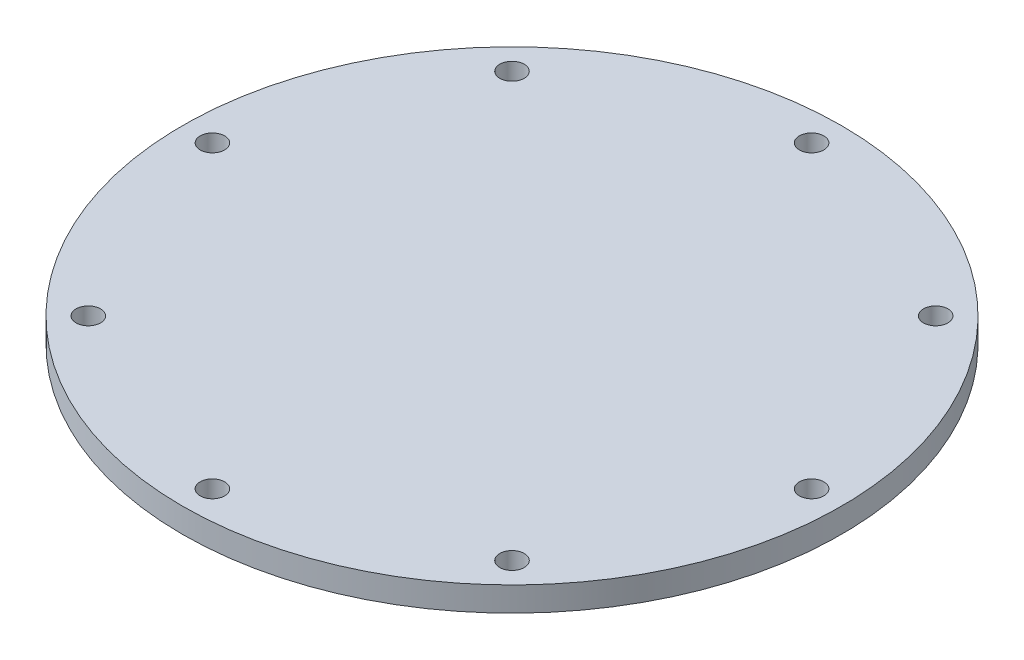
ISO-10303-21;
HEADER;
FILE_DESCRIPTION(('STEP AP214'),'2;1');
FILE_NAME('part.step','',(''),(''),'','','');
FILE_SCHEMA(('AUTOMOTIVE_DESIGN { 1 0 10303 214 1 1 1 1 }'));
ENDSEC;
DATA;
#1=APPLICATION_CONTEXT('core data for automotive mechanical design processes');
#2=APPLICATION_PROTOCOL_DEFINITION('international standard','automotive_design',2000,#1);
#3=PRODUCT_CONTEXT('',#1,'mechanical');
#4=PRODUCT('Part','Part','',(#3));
#5=PRODUCT_RELATED_PRODUCT_CATEGORY('part','',(#4));
#6=PRODUCT_DEFINITION_FORMATION('','',#4);
#7=PRODUCT_DEFINITION_CONTEXT('part definition',#1,'design');
#8=PRODUCT_DEFINITION('design','',#6,#7);
#9=PRODUCT_DEFINITION_SHAPE('','',#8);
#10=(LENGTH_UNIT() NAMED_UNIT(*) SI_UNIT(.MILLI.,.METRE.));
#11=(NAMED_UNIT(*) PLANE_ANGLE_UNIT() SI_UNIT($,.RADIAN.));
#12=(NAMED_UNIT(*) SI_UNIT($,.STERADIAN.) SOLID_ANGLE_UNIT());
#13=UNCERTAINTY_MEASURE_WITH_UNIT(LENGTH_MEASURE(1.E-05),#10,'distance_accuracy_value','');
#14=(GEOMETRIC_REPRESENTATION_CONTEXT(3) GLOBAL_UNCERTAINTY_ASSIGNED_CONTEXT((#13)) GLOBAL_UNIT_ASSIGNED_CONTEXT((#10,
#11,#12)) REPRESENTATION_CONTEXT('',''));
#15=CARTESIAN_POINT('',(0.,0.,0.));
#16=DIRECTION('',(0.,0.,1.));
#17=DIRECTION('',(1.,0.,0.));
#18=AXIS2_PLACEMENT_3D('',#15,#16,#17);
#19=CARTESIAN_POINT('',(0.,2.,0.));
#20=DIRECTION('',(0.,1.,0.));
#21=DIRECTION('',(0.,0.,1.));
#22=AXIS2_PLACEMENT_3D('',#19,#20,#21);
#23=PLANE('',#22);
#24=CARTESIAN_POINT('',(-24.4999999999979,2.,2.08749545080574E-12));
#25=DIRECTION('',(0.,1.,0.));
#26=DIRECTION('',(0.,0.,1.));
#27=AXIS2_PLACEMENT_3D('',#24,#25,#26);
#28=CIRCLE('',#27,1.00000000000285);
#29=CARTESIAN_POINT('',(-24.4999999999979,2.,1.00000000000494));
#30=VERTEX_POINT('',#29);
#31=EDGE_CURVE('E96',#30,#30,#28,.T.);
#32=ORIENTED_EDGE('',*,*,#31,.F.);
#33=EDGE_LOOP('',(#32));
#34=FACE_BOUND('',#33,.T.);
#35=CARTESIAN_POINT('',(4.16899013229566E-12,2.,24.5));
#36=DIRECTION('',(0.,1.,0.));
#37=DIRECTION('',(0.,0.,1.));
#38=AXIS2_PLACEMENT_3D('',#35,#36,#37);
#39=CIRCLE('',#38,1.00000000000415);
#40=CARTESIAN_POINT('',(4.16899013229566E-12,2.,25.5000000000041));
#41=VERTEX_POINT('',#40);
#42=EDGE_CURVE('E80',#41,#41,#39,.T.);
#43=ORIENTED_EDGE('',*,*,#42,.F.);
#44=EDGE_LOOP('',(#43));
#45=FACE_BOUND('',#44,.T.);
#46=CARTESIAN_POINT('',(24.5000000000021,2.,-2.08449506614783E-12));
#47=DIRECTION('',(0.,1.,0.));
#48=DIRECTION('',(0.,0.,1.));
#49=AXIS2_PLACEMENT_3D('',#46,#47,#48);
#50=CIRCLE('',#49,1.00000000000147);
#51=CARTESIAN_POINT('',(24.5000000000021,2.,0.999999999999382));
#52=VERTEX_POINT('',#51);
#53=EDGE_CURVE('E64',#52,#52,#50,.T.);
#54=ORIENTED_EDGE('',*,*,#53,.F.);
#55=EDGE_LOOP('',(#54));
#56=FACE_BOUND('',#55,.T.);
#57=CARTESIAN_POINT('',(17.324116139071,2.,-17.3241161390719));
#58=DIRECTION('',(0.,1.,0.));
#59=DIRECTION('',(0.,0.,1.));
#60=AXIS2_PLACEMENT_3D('',#57,#58,#59);
#61=CIRCLE('',#60,1.0000000000002);
#62=CARTESIAN_POINT('',(17.324116139071,2.,-16.3241161390717));
#63=VERTEX_POINT('',#62);
#64=EDGE_CURVE('E50',#63,#63,#61,.T.);
#65=ORIENTED_EDGE('',*,*,#64,.F.);
#66=EDGE_LOOP('',(#65));
#67=FACE_BOUND('',#66,.T.);
#68=CARTESIAN_POINT('',(0.,2.,0.));
#69=DIRECTION('',(0.,1.,0.));
#70=DIRECTION('',(0.,0.,1.));
#71=AXIS2_PLACEMENT_3D('',#68,#69,#70);
#72=CIRCLE('',#71,26.95);
#73=CARTESIAN_POINT('',(0.,2.,26.95));
#74=VERTEX_POINT('',#73);
#75=EDGE_CURVE('E10',#74,#74,#72,.T.);
#76=ORIENTED_EDGE('',*,*,#75,.T.);
#77=EDGE_LOOP('',(#76));
#78=FACE_BOUND('',#77,.T.);
#79=CARTESIAN_POINT('',(0.,2.,-24.5));
#80=DIRECTION('',(0.,1.,0.));
#81=DIRECTION('',(0.,0.,1.));
#82=AXIS2_PLACEMENT_3D('',#79,#80,#81);
#83=CIRCLE('',#82,1.);
#84=CARTESIAN_POINT('',(0.,2.,-23.5));
#85=VERTEX_POINT('',#84);
#86=EDGE_CURVE('E56',#85,#85,#83,.T.);
#87=ORIENTED_EDGE('',*,*,#86,.F.);
#88=EDGE_LOOP('',(#87));
#89=FACE_BOUND('',#88,.T.);
#90=CARTESIAN_POINT('',(17.324116139074,2.,17.3241161390689));
#91=DIRECTION('',(0.,1.,0.));
#92=DIRECTION('',(0.,0.,1.));
#93=AXIS2_PLACEMENT_3D('',#90,#91,#92);
#94=CIRCLE('',#93,1.0000000000031);
#95=CARTESIAN_POINT('',(17.324116139074,2.,18.324116139072));
#96=VERTEX_POINT('',#95);
#97=EDGE_CURVE('E72',#96,#96,#94,.T.);
#98=ORIENTED_EDGE('',*,*,#97,.F.);
#99=EDGE_LOOP('',(#98));
#100=FACE_BOUND('',#99,.T.);
#101=CARTESIAN_POINT('',(-17.3241161390669,2.,17.3241161390719));
#102=DIRECTION('',(0.,1.,0.));
#103=DIRECTION('',(0.,0.,1.));
#104=AXIS2_PLACEMENT_3D('',#101,#102,#103);
#105=CIRCLE('',#104,1.00000000000404);
#106=CARTESIAN_POINT('',(-17.3241161390669,2.,18.3241161390759));
#107=VERTEX_POINT('',#106);
#108=EDGE_CURVE('E88',#107,#107,#105,.T.);
#109=ORIENTED_EDGE('',*,*,#108,.F.);
#110=EDGE_LOOP('',(#109));
#111=FACE_BOUND('',#110,.T.);
#112=CARTESIAN_POINT('',(-17.3241161390698,2.,-17.3241161390689));
#113=DIRECTION('',(0.,1.,0.));
#114=DIRECTION('',(0.,0.,1.));
#115=AXIS2_PLACEMENT_3D('',#112,#113,#114);
#116=CIRCLE('',#115,1.00000000000131);
#117=CARTESIAN_POINT('',(-17.3241161390698,2.,-16.3241161390676));
#118=VERTEX_POINT('',#117);
#119=EDGE_CURVE('E104',#118,#118,#116,.T.);
#120=ORIENTED_EDGE('',*,*,#119,.F.);
#121=EDGE_LOOP('',(#120));
#122=FACE_BOUND('',#121,.T.);
#123=ADVANCED_FACE('F37',(#34,#45,#56,#67,#78,#89,#100,#111,#122),#23,.T.);
#124=CARTESIAN_POINT('',(0.,0.,0.));
#125=DIRECTION('',(0.,1.,0.));
#126=DIRECTION('',(0.,0.,1.));
#127=AXIS2_PLACEMENT_3D('',#124,#125,#126);
#128=PLANE('',#127);
#129=CARTESIAN_POINT('',(0.,0.,0.));
#130=DIRECTION('',(0.,1.,0.));
#131=DIRECTION('',(0.,0.,1.));
#132=AXIS2_PLACEMENT_3D('',#129,#130,#131);
#133=CIRCLE('',#132,26.95);
#134=CARTESIAN_POINT('',(0.,0.,26.95));
#135=VERTEX_POINT('',#134);
#136=EDGE_CURVE('E41',#135,#135,#133,.T.);
#137=ORIENTED_EDGE('',*,*,#136,.F.);
#138=EDGE_LOOP('',(#137));
#139=FACE_BOUND('',#138,.T.);
#140=CARTESIAN_POINT('',(17.324116139071,0.,-17.3241161390719));
#141=DIRECTION('',(0.,1.,0.));
#142=DIRECTION('',(0.,0.,1.));
#143=AXIS2_PLACEMENT_3D('',#140,#141,#142);
#144=CIRCLE('',#143,1.0000000000002);
#145=CARTESIAN_POINT('',(17.324116139071,0.,-16.3241161390717));
#146=VERTEX_POINT('',#145);
#147=EDGE_CURVE('E52',#146,#146,#144,.T.);
#148=ORIENTED_EDGE('',*,*,#147,.T.);
#149=EDGE_LOOP('',(#148));
#150=FACE_BOUND('',#149,.T.);
#151=CARTESIAN_POINT('',(0.,0.,-24.5));
#152=DIRECTION('',(0.,1.,0.));
#153=DIRECTION('',(0.,0.,1.));
#154=AXIS2_PLACEMENT_3D('',#151,#152,#153);
#155=CIRCLE('',#154,1.);
#156=CARTESIAN_POINT('',(0.,0.,-23.5));
#157=VERTEX_POINT('',#156);
#158=EDGE_CURVE('E60',#157,#157,#155,.T.);
#159=ORIENTED_EDGE('',*,*,#158,.T.);
#160=EDGE_LOOP('',(#159));
#161=FACE_BOUND('',#160,.T.);
#162=CARTESIAN_POINT('',(24.5000000000021,0.,-2.08449506614783E-12));
#163=DIRECTION('',(0.,1.,0.));
#164=DIRECTION('',(0.,0.,1.));
#165=AXIS2_PLACEMENT_3D('',#162,#163,#164);
#166=CIRCLE('',#165,1.00000000000147);
#167=CARTESIAN_POINT('',(24.5000000000021,0.,0.999999999999382));
#168=VERTEX_POINT('',#167);
#169=EDGE_CURVE('E68',#168,#168,#166,.T.);
#170=ORIENTED_EDGE('',*,*,#169,.T.);
#171=EDGE_LOOP('',(#170));
#172=FACE_BOUND('',#171,.T.);
#173=CARTESIAN_POINT('',(17.324116139074,0.,17.3241161390689));
#174=DIRECTION('',(0.,1.,0.));
#175=DIRECTION('',(0.,0.,1.));
#176=AXIS2_PLACEMENT_3D('',#173,#174,#175);
#177=CIRCLE('',#176,1.0000000000031);
#178=CARTESIAN_POINT('',(17.324116139074,0.,18.324116139072));
#179=VERTEX_POINT('',#178);
#180=EDGE_CURVE('E76',#179,#179,#177,.T.);
#181=ORIENTED_EDGE('',*,*,#180,.T.);
#182=EDGE_LOOP('',(#181));
#183=FACE_BOUND('',#182,.T.);
#184=CARTESIAN_POINT('',(4.16899013229566E-12,0.,24.5));
#185=DIRECTION('',(0.,1.,0.));
#186=DIRECTION('',(0.,0.,1.));
#187=AXIS2_PLACEMENT_3D('',#184,#185,#186);
#188=CIRCLE('',#187,1.00000000000415);
#189=CARTESIAN_POINT('',(4.16899013229566E-12,0.,25.5000000000041));
#190=VERTEX_POINT('',#189);
#191=EDGE_CURVE('E84',#190,#190,#188,.T.);
#192=ORIENTED_EDGE('',*,*,#191,.T.);
#193=EDGE_LOOP('',(#192));
#194=FACE_BOUND('',#193,.T.);
#195=CARTESIAN_POINT('',(-17.3241161390669,0.,17.3241161390719));
#196=DIRECTION('',(0.,1.,0.));
#197=DIRECTION('',(0.,0.,1.));
#198=AXIS2_PLACEMENT_3D('',#195,#196,#197);
#199=CIRCLE('',#198,1.00000000000404);
#200=CARTESIAN_POINT('',(-17.3241161390669,0.,18.3241161390759));
#201=VERTEX_POINT('',#200);
#202=EDGE_CURVE('E92',#201,#201,#199,.T.);
#203=ORIENTED_EDGE('',*,*,#202,.T.);
#204=EDGE_LOOP('',(#203));
#205=FACE_BOUND('',#204,.T.);
#206=CARTESIAN_POINT('',(-24.4999999999979,0.,2.08749545080574E-12));
#207=DIRECTION('',(0.,1.,0.));
#208=DIRECTION('',(0.,0.,1.));
#209=AXIS2_PLACEMENT_3D('',#206,#207,#208);
#210=CIRCLE('',#209,1.00000000000285);
#211=CARTESIAN_POINT('',(-24.4999999999979,0.,1.00000000000494));
#212=VERTEX_POINT('',#211);
#213=EDGE_CURVE('E100',#212,#212,#210,.T.);
#214=ORIENTED_EDGE('',*,*,#213,.T.);
#215=EDGE_LOOP('',(#214));
#216=FACE_BOUND('',#215,.T.);
#217=CARTESIAN_POINT('',(-17.3241161390698,0.,-17.3241161390689));
#218=DIRECTION('',(0.,1.,0.));
#219=DIRECTION('',(0.,0.,1.));
#220=AXIS2_PLACEMENT_3D('',#217,#218,#219);
#221=CIRCLE('',#220,1.00000000000131);
#222=CARTESIAN_POINT('',(-17.3241161390698,0.,-16.3241161390676));
#223=VERTEX_POINT('',#222);
#224=EDGE_CURVE('E108',#223,#223,#221,.T.);
#225=ORIENTED_EDGE('',*,*,#224,.T.);
#226=EDGE_LOOP('',(#225));
#227=FACE_BOUND('',#226,.T.);
#228=ADVANCED_FACE('F120',(#139,#150,#161,#172,#183,#194,#205,#216,#227),#128,.F.);
#229=CARTESIAN_POINT('',(0.,2.,0.));
#230=DIRECTION('',(0.,-1.,0.));
#231=DIRECTION('',(0.,0.,-1.));
#232=AXIS2_PLACEMENT_3D('',#229,#230,#231);
#233=CYLINDRICAL_SURFACE('',#232,26.95);
#234=ORIENTED_EDGE('',*,*,#75,.F.);
#235=EDGE_LOOP('',(#234));
#236=FACE_BOUND('',#235,.T.);
#237=ORIENTED_EDGE('',*,*,#136,.T.);
#238=EDGE_LOOP('',(#237));
#239=FACE_BOUND('',#238,.T.);
#240=ADVANCED_FACE('F39',(#236,#239),#233,.T.);
#241=CARTESIAN_POINT('',(17.324116139071,2.,-17.3241161390719));
#242=DIRECTION('',(0.,-1.,0.));
#243=DIRECTION('',(0.,0.,-1.));
#244=AXIS2_PLACEMENT_3D('',#241,#242,#243);
#245=CYLINDRICAL_SURFACE('',#244,1.0000000000002);
#246=ORIENTED_EDGE('',*,*,#64,.T.);
#247=EDGE_LOOP('',(#246));
#248=FACE_BOUND('',#247,.T.);
#249=ORIENTED_EDGE('',*,*,#147,.F.);
#250=EDGE_LOOP('',(#249));
#251=FACE_BOUND('',#250,.T.);
#252=ADVANCED_FACE('F130',(#248,#251),#245,.F.);
#253=CARTESIAN_POINT('',(0.,2.,-24.5));
#254=DIRECTION('',(0.,-1.,0.));
#255=DIRECTION('',(0.,0.,-1.));
#256=AXIS2_PLACEMENT_3D('',#253,#254,#255);
#257=CYLINDRICAL_SURFACE('',#256,1.);
#258=ORIENTED_EDGE('',*,*,#86,.T.);
#259=EDGE_LOOP('',(#258));
#260=FACE_BOUND('',#259,.T.);
#261=ORIENTED_EDGE('',*,*,#158,.F.);
#262=EDGE_LOOP('',(#261));
#263=FACE_BOUND('',#262,.T.);
#264=ADVANCED_FACE('F133',(#260,#263),#257,.F.);
#265=CARTESIAN_POINT('',(24.5000000000021,2.,-2.08449506614783E-12));
#266=DIRECTION('',(0.,-1.,0.));
#267=DIRECTION('',(0.,0.,-1.));
#268=AXIS2_PLACEMENT_3D('',#265,#266,#267);
#269=CYLINDRICAL_SURFACE('',#268,1.00000000000147);
#270=ORIENTED_EDGE('',*,*,#53,.T.);
#271=EDGE_LOOP('',(#270));
#272=FACE_BOUND('',#271,.T.);
#273=ORIENTED_EDGE('',*,*,#169,.F.);
#274=EDGE_LOOP('',(#273));
#275=FACE_BOUND('',#274,.T.);
#276=ADVANCED_FACE('F137',(#272,#275),#269,.F.);
#277=CARTESIAN_POINT('',(17.324116139074,2.,17.3241161390689));
#278=DIRECTION('',(0.,-1.,0.));
#279=DIRECTION('',(0.,0.,-1.));
#280=AXIS2_PLACEMENT_3D('',#277,#278,#279);
#281=CYLINDRICAL_SURFACE('',#280,1.0000000000031);
#282=ORIENTED_EDGE('',*,*,#97,.T.);
#283=EDGE_LOOP('',(#282));
#284=FACE_BOUND('',#283,.T.);
#285=ORIENTED_EDGE('',*,*,#180,.F.);
#286=EDGE_LOOP('',(#285));
#287=FACE_BOUND('',#286,.T.);
#288=ADVANCED_FACE('F141',(#284,#287),#281,.F.);
#289=CARTESIAN_POINT('',(4.16899013229566E-12,2.,24.5));
#290=DIRECTION('',(0.,-1.,0.));
#291=DIRECTION('',(0.,0.,-1.));
#292=AXIS2_PLACEMENT_3D('',#289,#290,#291);
#293=CYLINDRICAL_SURFACE('',#292,1.00000000000415);
#294=ORIENTED_EDGE('',*,*,#42,.T.);
#295=EDGE_LOOP('',(#294));
#296=FACE_BOUND('',#295,.T.);
#297=ORIENTED_EDGE('',*,*,#191,.F.);
#298=EDGE_LOOP('',(#297));
#299=FACE_BOUND('',#298,.T.);
#300=ADVANCED_FACE('F145',(#296,#299),#293,.F.);
#301=CARTESIAN_POINT('',(-17.3241161390669,2.,17.3241161390719));
#302=DIRECTION('',(0.,-1.,0.));
#303=DIRECTION('',(0.,0.,-1.));
#304=AXIS2_PLACEMENT_3D('',#301,#302,#303);
#305=CYLINDRICAL_SURFACE('',#304,1.00000000000404);
#306=ORIENTED_EDGE('',*,*,#108,.T.);
#307=EDGE_LOOP('',(#306));
#308=FACE_BOUND('',#307,.T.);
#309=ORIENTED_EDGE('',*,*,#202,.F.);
#310=EDGE_LOOP('',(#309));
#311=FACE_BOUND('',#310,.T.);
#312=ADVANCED_FACE('F149',(#308,#311),#305,.F.);
#313=CARTESIAN_POINT('',(-24.4999999999979,2.,2.08749545080574E-12));
#314=DIRECTION('',(0.,-1.,0.));
#315=DIRECTION('',(0.,0.,-1.));
#316=AXIS2_PLACEMENT_3D('',#313,#314,#315);
#317=CYLINDRICAL_SURFACE('',#316,1.00000000000285);
#318=ORIENTED_EDGE('',*,*,#31,.T.);
#319=EDGE_LOOP('',(#318));
#320=FACE_BOUND('',#319,.T.);
#321=ORIENTED_EDGE('',*,*,#213,.F.);
#322=EDGE_LOOP('',(#321));
#323=FACE_BOUND('',#322,.T.);
#324=ADVANCED_FACE('F153',(#320,#323),#317,.F.);
#325=CARTESIAN_POINT('',(-17.3241161390698,2.,-17.3241161390689));
#326=DIRECTION('',(0.,-1.,0.));
#327=DIRECTION('',(0.,0.,-1.));
#328=AXIS2_PLACEMENT_3D('',#325,#326,#327);
#329=CYLINDRICAL_SURFACE('',#328,1.00000000000131);
#330=ORIENTED_EDGE('',*,*,#119,.T.);
#331=EDGE_LOOP('',(#330));
#332=FACE_BOUND('',#331,.T.);
#333=ORIENTED_EDGE('',*,*,#224,.F.);
#334=EDGE_LOOP('',(#333));
#335=FACE_BOUND('',#334,.T.);
#336=ADVANCED_FACE('F116',(#332,#335),#329,.F.);
#337=CLOSED_SHELL('',(#123,#228,#240,#252,#264,#276,#288,#300,#312,#324,#336));
#338=MANIFOLD_SOLID_BREP('B2',#337);
#339=ADVANCED_BREP_SHAPE_REPRESENTATION('',(#18,#338),#14);
#340=SHAPE_DEFINITION_REPRESENTATION(#9,#339);
ENDSEC;
END-ISO-10303-21;
